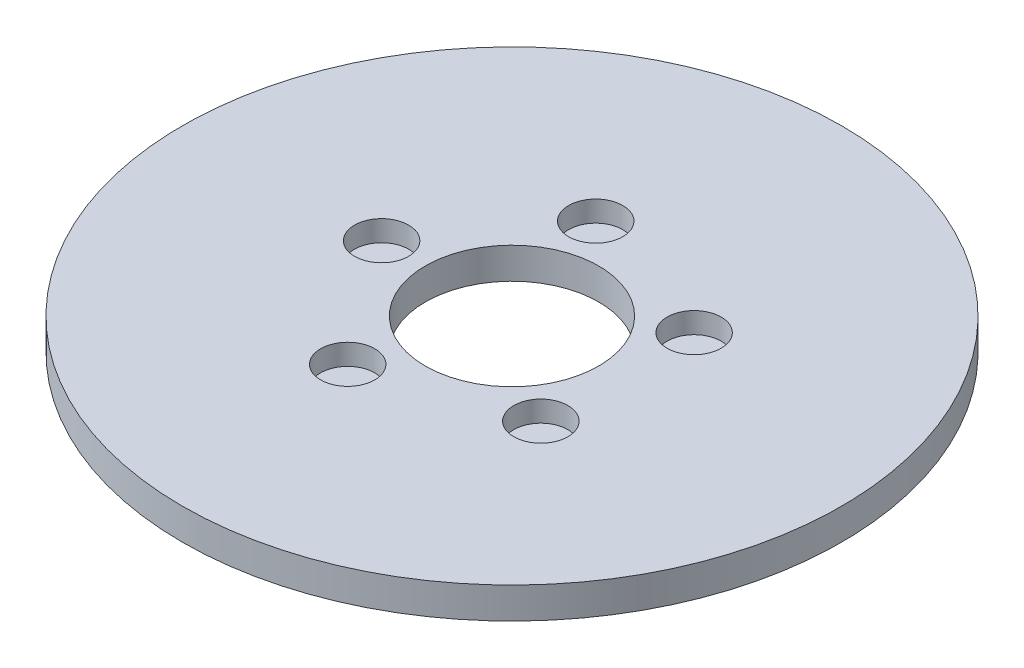
ISO-10303-21;
HEADER;
FILE_DESCRIPTION(('STEP AP214'),'2;1');
FILE_NAME('part.step','',(''),(''),'','','');
FILE_SCHEMA(('AUTOMOTIVE_DESIGN { 1 0 10303 214 1 1 1 1 }'));
ENDSEC;
DATA;
#1=APPLICATION_CONTEXT('core data for automotive mechanical design processes');
#2=APPLICATION_PROTOCOL_DEFINITION('international standard','automotive_design',2000,#1);
#3=PRODUCT_CONTEXT('',#1,'mechanical');
#4=PRODUCT('Part','Part','',(#3));
#5=PRODUCT_RELATED_PRODUCT_CATEGORY('part','',(#4));
#6=PRODUCT_DEFINITION_FORMATION('','',#4);
#7=PRODUCT_DEFINITION_CONTEXT('part definition',#1,'design');
#8=PRODUCT_DEFINITION('design','',#6,#7);
#9=PRODUCT_DEFINITION_SHAPE('','',#8);
#10=(LENGTH_UNIT() NAMED_UNIT(*) SI_UNIT(.MILLI.,.METRE.));
#11=(NAMED_UNIT(*) PLANE_ANGLE_UNIT() SI_UNIT($,.RADIAN.));
#12=(NAMED_UNIT(*) SI_UNIT($,.STERADIAN.) SOLID_ANGLE_UNIT());
#13=UNCERTAINTY_MEASURE_WITH_UNIT(LENGTH_MEASURE(1.E-05),#10,'distance_accuracy_value','');
#14=(GEOMETRIC_REPRESENTATION_CONTEXT(3) GLOBAL_UNCERTAINTY_ASSIGNED_CONTEXT((#13)) GLOBAL_UNIT_ASSIGNED_CONTEXT((#10,
#11,#12)) REPRESENTATION_CONTEXT('',''));
#15=CARTESIAN_POINT('',(0.,0.,0.));
#16=DIRECTION('',(0.,0.,1.));
#17=DIRECTION('',(1.,0.,0.));
#18=AXIS2_PLACEMENT_3D('',#15,#16,#17);
#19=CARTESIAN_POINT('',(0.,9.,0.));
#20=DIRECTION('',(0.,-1.,0.));
#21=DIRECTION('',(0.,0.,-1.));
#22=AXIS2_PLACEMENT_3D('',#19,#20,#21);
#23=CYLINDRICAL_SURFACE('',#22,95.);
#24=CARTESIAN_POINT('',(0.,9.,0.));
#25=DIRECTION('',(0.,1.,0.));
#26=DIRECTION('',(0.,0.,1.));
#27=AXIS2_PLACEMENT_3D('',#24,#25,#26);
#28=CIRCLE('',#27,95.);
#29=CARTESIAN_POINT('',(0.,9.,95.));
#30=VERTEX_POINT('',#29);
#31=EDGE_CURVE('E10',#30,#30,#28,.T.);
#32=ORIENTED_EDGE('',*,*,#31,.F.);
#33=EDGE_LOOP('',(#32));
#34=FACE_BOUND('',#33,.T.);
#35=CARTESIAN_POINT('',(0.,0.,0.));
#36=DIRECTION('',(0.,1.,0.));
#37=DIRECTION('',(0.,0.,1.));
#38=AXIS2_PLACEMENT_3D('',#35,#36,#37);
#39=CIRCLE('',#38,95.);
#40=CARTESIAN_POINT('',(0.,0.,95.));
#41=VERTEX_POINT('',#40);
#42=EDGE_CURVE('E37',#41,#41,#39,.T.);
#43=ORIENTED_EDGE('',*,*,#42,.T.);
#44=EDGE_LOOP('',(#43));
#45=FACE_BOUND('',#44,.T.);
#46=ADVANCED_FACE('F40',(#34,#45),#23,.T.);
#47=CARTESIAN_POINT('',(0.,9.,0.));
#48=DIRECTION('',(0.,1.,0.));
#49=DIRECTION('',(0.,0.,1.));
#50=AXIS2_PLACEMENT_3D('',#47,#48,#49);
#51=PLANE('',#50);
#52=CARTESIAN_POINT('',(-11.615342499618,9.,-35.748348389725));
#53=DIRECTION('',(0.,1.,0.));
#54=DIRECTION('',(-0.95105651629515,0.,0.309016994374958));
#55=AXIS2_PLACEMENT_3D('',#52,#53,#54);
#56=CIRCLE('',#55,7.79796181933174);
#57=CARTESIAN_POINT('',(-11.615342499618,9.,-27.9503865703932));
#58=VERTEX_POINT('',#57);
#59=EDGE_CURVE('E70',#58,#58,#56,.T.);
#60=ORIENTED_EDGE('',*,*,#59,.F.);
#61=EDGE_LOOP('',(#60));
#62=FACE_BOUND('',#61,.T.);
#63=CARTESIAN_POINT('',(30.4093614549698,9.,-22.093694346523));
#64=DIRECTION('',(0.,1.,0.));
#65=DIRECTION('',(-0.58778525229248,0.,-0.809016994374942));
#66=AXIS2_PLACEMENT_3D('',#63,#64,#65);
#67=CIRCLE('',#66,7.79796181933174);
#68=CARTESIAN_POINT('',(30.4093614549698,9.,-14.2957325271912));
#69=VERTEX_POINT('',#68);
#70=EDGE_CURVE('E71',#69,#69,#67,.T.);
#71=ORIENTED_EDGE('',*,*,#70,.F.);
#72=EDGE_LOOP('',(#71));
#73=FACE_BOUND('',#72,.T.);
#74=CARTESIAN_POINT('',(30.4093614549701,9.,22.0936943465225));
#75=DIRECTION('',(0.,1.,0.));
#76=DIRECTION('',(0.587785252292469,0.,-0.809016994374951));
#77=AXIS2_PLACEMENT_3D('',#74,#75,#76);
#78=CIRCLE('',#77,7.79796181933174);
#79=CARTESIAN_POINT('',(30.4093614549701,9.,29.8916561658543));
#80=VERTEX_POINT('',#79);
#81=EDGE_CURVE('E78',#80,#80,#78,.T.);
#82=ORIENTED_EDGE('',*,*,#81,.F.);
#83=EDGE_LOOP('',(#82));
#84=FACE_BOUND('',#83,.T.);
#85=CARTESIAN_POINT('',(-11.6153424996175,9.,35.7483483897251));
#86=DIRECTION('',(0.,1.,0.));
#87=DIRECTION('',(0.951056516295155,0.,0.309016994374945));
#88=AXIS2_PLACEMENT_3D('',#85,#86,#87);
#89=CIRCLE('',#88,7.79796181933174);
#90=CARTESIAN_POINT('',(-11.6153424996175,9.,43.5463102090569));
#91=VERTEX_POINT('',#90);
#92=EDGE_CURVE('E61',#91,#91,#89,.T.);
#93=ORIENTED_EDGE('',*,*,#92,.F.);
#94=EDGE_LOOP('',(#93));
#95=FACE_BOUND('',#94,.T.);
#96=CARTESIAN_POINT('',(-37.5880379107048,9.,0.));
#97=DIRECTION('',(0.,1.,0.));
#98=DIRECTION('',(0.,0.,1.));
#99=AXIS2_PLACEMENT_3D('',#96,#97,#98);
#100=CIRCLE('',#99,7.79796181933174);
#101=CARTESIAN_POINT('',(-37.5880379107048,9.,7.79796181933174));
#102=VERTEX_POINT('',#101);
#103=EDGE_CURVE('E54',#102,#102,#100,.T.);
#104=ORIENTED_EDGE('',*,*,#103,.F.);
#105=EDGE_LOOP('',(#104));
#106=FACE_BOUND('',#105,.T.);
#107=CARTESIAN_POINT('',(0.,9.,0.));
#108=DIRECTION('',(0.,1.,0.));
#109=DIRECTION('',(0.,0.,1.));
#110=AXIS2_PLACEMENT_3D('',#107,#108,#109);
#111=CIRCLE('',#110,25.);
#112=CARTESIAN_POINT('',(0.,9.,25.));
#113=VERTEX_POINT('',#112);
#114=EDGE_CURVE('E50',#113,#113,#111,.T.);
#115=ORIENTED_EDGE('',*,*,#114,.F.);
#116=EDGE_LOOP('',(#115));
#117=FACE_BOUND('',#116,.T.);
#118=ORIENTED_EDGE('',*,*,#31,.T.);
#119=EDGE_LOOP('',(#118));
#120=FACE_BOUND('',#119,.T.);
#121=ADVANCED_FACE('F94',(#62,#73,#84,#95,#106,#117,#120),#51,.T.);
#122=CARTESIAN_POINT('',(0.,0.,0.));
#123=DIRECTION('',(0.,1.,0.));
#124=DIRECTION('',(0.,0.,1.));
#125=AXIS2_PLACEMENT_3D('',#122,#123,#124);
#126=PLANE('',#125);
#127=CARTESIAN_POINT('',(0.,0.,0.));
#128=DIRECTION('',(0.,1.,0.));
#129=DIRECTION('',(0.,0.,1.));
#130=AXIS2_PLACEMENT_3D('',#127,#128,#129);
#131=CIRCLE('',#130,25.);
#132=CARTESIAN_POINT('',(0.,0.,25.));
#133=VERTEX_POINT('',#132);
#134=EDGE_CURVE('E47',#133,#133,#131,.T.);
#135=ORIENTED_EDGE('',*,*,#134,.T.);
#136=EDGE_LOOP('',(#135));
#137=FACE_BOUND('',#136,.T.);
#138=ORIENTED_EDGE('',*,*,#42,.F.);
#139=EDGE_LOOP('',(#138));
#140=FACE_BOUND('',#139,.T.);
#141=ADVANCED_FACE('F100',(#137,#140),#126,.F.);
#142=CARTESIAN_POINT('',(0.,9.,0.));
#143=DIRECTION('',(0.,-1.,0.));
#144=DIRECTION('',(0.,0.,-1.));
#145=AXIS2_PLACEMENT_3D('',#142,#143,#144);
#146=CYLINDRICAL_SURFACE('',#145,25.);
#147=ORIENTED_EDGE('',*,*,#114,.T.);
#148=EDGE_LOOP('',(#147));
#149=FACE_BOUND('',#148,.T.);
#150=ORIENTED_EDGE('',*,*,#134,.F.);
#151=EDGE_LOOP('',(#150));
#152=FACE_BOUND('',#151,.T.);
#153=ADVANCED_FACE('F106',(#149,#152),#146,.F.);
#154=CARTESIAN_POINT('',(-37.5880379107048,2.9747478807375,0.));
#155=DIRECTION('',(0.,1.,0.));
#156=DIRECTION('',(0.,0.,1.));
#157=AXIS2_PLACEMENT_3D('',#154,#155,#156);
#158=CYLINDRICAL_SURFACE('',#157,7.79796181933174);
#159=CARTESIAN_POINT('',(-37.5880379107048,2.9747478807375,0.));
#160=DIRECTION('',(0.,1.,0.));
#161=DIRECTION('',(0.,0.,1.));
#162=AXIS2_PLACEMENT_3D('',#159,#160,#161);
#163=CIRCLE('',#162,7.79796181933174);
#164=CARTESIAN_POINT('',(-37.5880379107048,2.9747478807375,7.79796181933174));
#165=VERTEX_POINT('',#164);
#166=EDGE_CURVE('E55',#165,#165,#163,.T.);
#167=CARTESIAN_POINT('',(-37.5880379107048,2.9747478807375,7.79796181933174));
#168=CARTESIAN_POINT('',(-37.5880379107048,3.03751092364648,7.79796181933174));
#169=CARTESIAN_POINT('',(-37.5880379107048,3.10027396655547,7.79796181933174));
#170=CARTESIAN_POINT('',(-37.5880379107048,3.22580005237343,7.79796181933174));
#171=CARTESIAN_POINT('',(-37.5880379107048,3.28856309528242,7.79796181933174));
#172=CARTESIAN_POINT('',(-37.5880379107048,3.41408918110039,7.79796181933174));
#173=CARTESIAN_POINT('',(-37.5880379107048,3.47685222400937,7.79796181933174));
#174=CARTESIAN_POINT('',(-37.5880379107048,3.60237830982734,7.79796181933174));
#175=CARTESIAN_POINT('',(-37.5880379107048,3.66514135273633,7.79796181933174));
#176=CARTESIAN_POINT('',(-37.5880379107048,3.79066743855429,7.79796181933174));
#177=CARTESIAN_POINT('',(-37.5880379107048,3.85343048146328,7.79796181933174));
#178=CARTESIAN_POINT('',(-37.5880379107048,3.97895656728125,7.79796181933174));
#179=CARTESIAN_POINT('',(-37.5880379107048,4.04171961019023,7.79796181933174));
#180=CARTESIAN_POINT('',(-37.5880379107048,4.1672456960082,7.79796181933174));
#181=CARTESIAN_POINT('',(-37.5880379107048,4.23000873891719,7.79796181933174));
#182=CARTESIAN_POINT('',(-37.5880379107048,4.35553482473515,7.79796181933174));
#183=CARTESIAN_POINT('',(-37.5880379107048,4.41829786764414,7.79796181933174));
#184=CARTESIAN_POINT('',(-37.5880379107048,4.54382395346211,7.79796181933174));
#185=CARTESIAN_POINT('',(-37.5880379107048,4.60658699637109,7.79796181933174));
#186=CARTESIAN_POINT('',(-37.5880379107048,4.73211308218906,7.79796181933174));
#187=CARTESIAN_POINT('',(-37.5880379107048,4.79487612509805,7.79796181933174));
#188=CARTESIAN_POINT('',(-37.5880379107048,4.92040221091601,7.79796181933174));
#189=CARTESIAN_POINT('',(-37.5880379107048,4.983165253825,7.79796181933174));
#190=CARTESIAN_POINT('',(-37.5880379107048,5.10869133964297,7.79796181933174));
#191=CARTESIAN_POINT('',(-37.5880379107048,5.17145438255195,7.79796181933174));
#192=CARTESIAN_POINT('',(-37.5880379107048,5.29698046836992,7.79796181933174));
#193=CARTESIAN_POINT('',(-37.5880379107048,5.3597435112789,7.79796181933174));
#194=CARTESIAN_POINT('',(-37.5880379107048,5.48526959709687,7.79796181933174));
#195=CARTESIAN_POINT('',(-37.5880379107048,5.54803264000586,7.79796181933174));
#196=CARTESIAN_POINT('',(-37.5880379107048,5.67355872582383,7.79796181933174));
#197=CARTESIAN_POINT('',(-37.5880379107048,5.73632176873281,7.79796181933174));
#198=CARTESIAN_POINT('',(-37.5880379107048,5.86184785455078,7.79796181933174));
#199=CARTESIAN_POINT('',(-37.5880379107048,5.92461089745976,7.79796181933174));
#200=CARTESIAN_POINT('',(-37.5880379107048,6.05013698327773,7.79796181933174));
#201=CARTESIAN_POINT('',(-37.5880379107048,6.11290002618672,7.79796181933174));
#202=CARTESIAN_POINT('',(-37.5880379107048,6.23842611200469,7.79796181933174));
#203=CARTESIAN_POINT('',(-37.5880379107048,6.30118915491367,7.79796181933174));
#204=CARTESIAN_POINT('',(-37.5880379107048,6.42671524073164,7.79796181933174));
#205=CARTESIAN_POINT('',(-37.5880379107048,6.48947828364062,7.79796181933174));
#206=CARTESIAN_POINT('',(-37.5880379107048,6.61500436945859,7.79796181933174));
#207=CARTESIAN_POINT('',(-37.5880379107048,6.67776741236758,7.79796181933174));
#208=CARTESIAN_POINT('',(-37.5880379107048,6.80329349818555,7.79796181933174));
#209=CARTESIAN_POINT('',(-37.5880379107048,6.86605654109453,7.79796181933174));
#210=CARTESIAN_POINT('',(-37.5880379107048,6.9915826269125,7.79796181933174));
#211=CARTESIAN_POINT('',(-37.5880379107048,7.05434566982148,7.79796181933174));
#212=CARTESIAN_POINT('',(-37.5880379107048,7.17987175563945,7.79796181933174));
#213=CARTESIAN_POINT('',(-37.5880379107048,7.24263479854844,7.79796181933174));
#214=CARTESIAN_POINT('',(-37.5880379107048,7.3681608843664,7.79796181933174));
#215=CARTESIAN_POINT('',(-37.5880379107048,7.43092392727539,7.79796181933174));
#216=CARTESIAN_POINT('',(-37.5880379107048,7.55645001309336,7.79796181933174));
#217=CARTESIAN_POINT('',(-37.5880379107048,7.61921305600234,7.79796181933174));
#218=CARTESIAN_POINT('',(-37.5880379107048,7.74473914182031,7.79796181933174));
#219=CARTESIAN_POINT('',(-37.5880379107048,7.8075021847293,7.79796181933174));
#220=CARTESIAN_POINT('',(-37.5880379107048,7.93302827054726,7.79796181933174));
#221=CARTESIAN_POINT('',(-37.5880379107048,7.99579131345625,7.79796181933174));
#222=CARTESIAN_POINT('',(-37.5880379107048,8.12131739927422,7.79796181933174));
#223=CARTESIAN_POINT('',(-37.5880379107048,8.1840804421832,7.79796181933174));
#224=CARTESIAN_POINT('',(-37.5880379107048,8.30960652800117,7.79796181933174));
#225=CARTESIAN_POINT('',(-37.5880379107048,8.37236957091016,7.79796181933174));
#226=CARTESIAN_POINT('',(-37.5880379107048,8.49789565672812,7.79796181933174));
#227=CARTESIAN_POINT('',(-37.5880379107048,8.56065869963711,7.79796181933174));
#228=CARTESIAN_POINT('',(-37.5880379107048,8.68618478545508,7.79796181933174));
#229=CARTESIAN_POINT('',(-37.5880379107048,8.74894782836406,7.79796181933174));
#230=CARTESIAN_POINT('',(-37.5880379107048,8.87447391418203,7.79796181933174));
#231=CARTESIAN_POINT('',(-37.5880379107048,8.93723695709101,7.79796181933174));
#232=CARTESIAN_POINT('',(-37.5880379107048,9.,7.79796181933174));
#233=B_SPLINE_CURVE_WITH_KNOTS('',3,(#167,#168,#169,#170,#171,#172,#173,#174,#175,#176,#177,
#178,#179,#180,#181,#182,#183,#184,#185,#186,#187,#188,#189,#190,#191,#192,#193,#194,#195,#196,
#197,#198,#199,#200,#201,#202,#203,#204,#205,#206,#207,#208,#209,#210,#211,#212,#213,#214,#215,
#216,#217,#218,#219,#220,#221,#222,#223,#224,#225,#226,#227,#228,#229,#230,#231,#232),
.UNSPECIFIED.,.F.,.F.,(4,2,2,2,2,2,2,2,2,2,2,2,2,2,2,2,2,2,2,2,2,2,2,2,2,2,2,2,2,2,2,2,4),(0.,
0.188289128726953,0.376578257453906,0.564867386180859,0.753156514907813,0.941445643634766,
1.12973477236172,1.31802390108867,1.50631302981563,1.69460215854258,1.88289128726953,
2.07118041599649,2.25946954472344,2.44775867345039,2.63604780217734,2.8243369309043,
3.01262605963125,3.2009151883582,3.38920431708516,3.57749344581211,3.76578257453906,
3.95407170326602,4.14236083199297,4.33064996071992,4.51893908944688,4.70722821817383,
4.89551734690078,5.08380647562774,5.27209560435469,5.46038473308164,5.6486738618086,
5.83696299053555,6.0252521192625),.UNSPECIFIED.);
#234=EDGE_CURVE('BSEAM108',#165,#102,#233,.T.);
#235=ORIENTED_EDGE('',*,*,#166,.F.);
#236=ORIENTED_EDGE('',*,*,#103,.T.);
#237=ORIENTED_EDGE('',*,*,#234,.T.);
#238=ORIENTED_EDGE('',*,*,#234,.F.);
#239=EDGE_LOOP('',(#235,#237,#236,#238));
#240=FACE_BOUND('',#239,.T.);
#241=ADVANCED_FACE('F108',(#240),#158,.F.);
#242=CARTESIAN_POINT('',(-37.5880379107048,2.9747478807375,0.));
#243=DIRECTION('',(0.,1.,0.));
#244=DIRECTION('',(0.,0.,1.));
#245=AXIS2_PLACEMENT_3D('',#242,#243,#244);
#246=PLANE('',#245);
#247=ORIENTED_EDGE('',*,*,#166,.T.);
#248=EDGE_LOOP('',(#247));
#249=FACE_BOUND('',#248,.T.);
#250=ADVANCED_FACE('F138',(#249),#246,.T.);
#251=CARTESIAN_POINT('',(-11.6153424996175,2.9747478807375,35.7483483897251));
#252=DIRECTION('',(0.,1.,0.));
#253=DIRECTION('',(0.,0.,1.));
#254=AXIS2_PLACEMENT_3D('',#251,#252,#253);
#255=CYLINDRICAL_SURFACE('',#254,7.79796181933174);
#256=CARTESIAN_POINT('',(-11.6153424996175,2.9747478807375,35.7483483897251));
#257=DIRECTION('',(0.,1.,0.));
#258=DIRECTION('',(0.951056516295155,0.,0.309016994374945));
#259=AXIS2_PLACEMENT_3D('',#256,#257,#258);
#260=CIRCLE('',#259,7.79796181933174);
#261=CARTESIAN_POINT('',(-11.6153424996175,2.9747478807375,43.5463102090569));
#262=VERTEX_POINT('',#261);
#263=EDGE_CURVE('E59',#262,#262,#260,.T.);
#264=CARTESIAN_POINT('',(-11.6153424996175,2.9747478807375,43.5463102090569));
#265=CARTESIAN_POINT('',(-11.6153424996175,3.03751092364648,43.5463102090569));
#266=CARTESIAN_POINT('',(-11.6153424996175,3.10027396655547,43.5463102090569));
#267=CARTESIAN_POINT('',(-11.6153424996175,3.22580005237343,43.5463102090569));
#268=CARTESIAN_POINT('',(-11.6153424996175,3.28856309528242,43.5463102090569));
#269=CARTESIAN_POINT('',(-11.6153424996175,3.41408918110039,43.5463102090569));
#270=CARTESIAN_POINT('',(-11.6153424996175,3.47685222400937,43.5463102090569));
#271=CARTESIAN_POINT('',(-11.6153424996175,3.60237830982734,43.5463102090569));
#272=CARTESIAN_POINT('',(-11.6153424996175,3.66514135273633,43.5463102090569));
#273=CARTESIAN_POINT('',(-11.6153424996175,3.79066743855429,43.5463102090569));
#274=CARTESIAN_POINT('',(-11.6153424996175,3.85343048146328,43.5463102090569));
#275=CARTESIAN_POINT('',(-11.6153424996175,3.97895656728125,43.5463102090569));
#276=CARTESIAN_POINT('',(-11.6153424996175,4.04171961019023,43.5463102090569));
#277=CARTESIAN_POINT('',(-11.6153424996175,4.1672456960082,43.5463102090569));
#278=CARTESIAN_POINT('',(-11.6153424996175,4.23000873891719,43.5463102090569));
#279=CARTESIAN_POINT('',(-11.6153424996175,4.35553482473515,43.5463102090569));
#280=CARTESIAN_POINT('',(-11.6153424996175,4.41829786764414,43.5463102090569));
#281=CARTESIAN_POINT('',(-11.6153424996175,4.54382395346211,43.5463102090569));
#282=CARTESIAN_POINT('',(-11.6153424996175,4.60658699637109,43.5463102090569));
#283=CARTESIAN_POINT('',(-11.6153424996175,4.73211308218906,43.5463102090569));
#284=CARTESIAN_POINT('',(-11.6153424996175,4.79487612509805,43.5463102090569));
#285=CARTESIAN_POINT('',(-11.6153424996175,4.92040221091601,43.5463102090569));
#286=CARTESIAN_POINT('',(-11.6153424996175,4.983165253825,43.5463102090569));
#287=CARTESIAN_POINT('',(-11.6153424996175,5.10869133964297,43.5463102090569));
#288=CARTESIAN_POINT('',(-11.6153424996175,5.17145438255195,43.5463102090569));
#289=CARTESIAN_POINT('',(-11.6153424996175,5.29698046836992,43.5463102090569));
#290=CARTESIAN_POINT('',(-11.6153424996175,5.3597435112789,43.5463102090569));
#291=CARTESIAN_POINT('',(-11.6153424996175,5.48526959709687,43.5463102090569));
#292=CARTESIAN_POINT('',(-11.6153424996175,5.54803264000586,43.5463102090569));
#293=CARTESIAN_POINT('',(-11.6153424996175,5.67355872582383,43.5463102090569));
#294=CARTESIAN_POINT('',(-11.6153424996175,5.73632176873281,43.5463102090569));
#295=CARTESIAN_POINT('',(-11.6153424996175,5.86184785455078,43.5463102090569));
#296=CARTESIAN_POINT('',(-11.6153424996175,5.92461089745976,43.5463102090569));
#297=CARTESIAN_POINT('',(-11.6153424996175,6.05013698327773,43.5463102090569));
#298=CARTESIAN_POINT('',(-11.6153424996175,6.11290002618672,43.5463102090569));
#299=CARTESIAN_POINT('',(-11.6153424996175,6.23842611200469,43.5463102090569));
#300=CARTESIAN_POINT('',(-11.6153424996175,6.30118915491367,43.5463102090569));
#301=CARTESIAN_POINT('',(-11.6153424996175,6.42671524073164,43.5463102090569));
#302=CARTESIAN_POINT('',(-11.6153424996175,6.48947828364062,43.5463102090569));
#303=CARTESIAN_POINT('',(-11.6153424996175,6.61500436945859,43.5463102090569));
#304=CARTESIAN_POINT('',(-11.6153424996175,6.67776741236758,43.5463102090569));
#305=CARTESIAN_POINT('',(-11.6153424996175,6.80329349818555,43.5463102090569));
#306=CARTESIAN_POINT('',(-11.6153424996175,6.86605654109453,43.5463102090569));
#307=CARTESIAN_POINT('',(-11.6153424996175,6.9915826269125,43.5463102090569));
#308=CARTESIAN_POINT('',(-11.6153424996175,7.05434566982148,43.5463102090569));
#309=CARTESIAN_POINT('',(-11.6153424996175,7.17987175563945,43.5463102090569));
#310=CARTESIAN_POINT('',(-11.6153424996175,7.24263479854844,43.5463102090569));
#311=CARTESIAN_POINT('',(-11.6153424996175,7.3681608843664,43.5463102090569));
#312=CARTESIAN_POINT('',(-11.6153424996175,7.43092392727539,43.5463102090569));
#313=CARTESIAN_POINT('',(-11.6153424996175,7.55645001309336,43.5463102090569));
#314=CARTESIAN_POINT('',(-11.6153424996175,7.61921305600234,43.5463102090569));
#315=CARTESIAN_POINT('',(-11.6153424996175,7.74473914182031,43.5463102090569));
#316=CARTESIAN_POINT('',(-11.6153424996175,7.8075021847293,43.5463102090569));
#317=CARTESIAN_POINT('',(-11.6153424996175,7.93302827054726,43.5463102090569));
#318=CARTESIAN_POINT('',(-11.6153424996175,7.99579131345625,43.5463102090569));
#319=CARTESIAN_POINT('',(-11.6153424996175,8.12131739927422,43.5463102090569));
#320=CARTESIAN_POINT('',(-11.6153424996175,8.1840804421832,43.5463102090569));
#321=CARTESIAN_POINT('',(-11.6153424996175,8.30960652800117,43.5463102090569));
#322=CARTESIAN_POINT('',(-11.6153424996175,8.37236957091016,43.5463102090569));
#323=CARTESIAN_POINT('',(-11.6153424996175,8.49789565672812,43.5463102090569));
#324=CARTESIAN_POINT('',(-11.6153424996175,8.56065869963711,43.5463102090569));
#325=CARTESIAN_POINT('',(-11.6153424996175,8.68618478545508,43.5463102090569));
#326=CARTESIAN_POINT('',(-11.6153424996175,8.74894782836406,43.5463102090569));
#327=CARTESIAN_POINT('',(-11.6153424996175,8.87447391418203,43.5463102090569));
#328=CARTESIAN_POINT('',(-11.6153424996175,8.93723695709101,43.5463102090569));
#329=CARTESIAN_POINT('',(-11.6153424996175,9.,43.5463102090569));
#330=B_SPLINE_CURVE_WITH_KNOTS('',3,(#264,#265,#266,#267,#268,#269,#270,#271,#272,#273,#274,
#275,#276,#277,#278,#279,#280,#281,#282,#283,#284,#285,#286,#287,#288,#289,#290,#291,#292,#293,
#294,#295,#296,#297,#298,#299,#300,#301,#302,#303,#304,#305,#306,#307,#308,#309,#310,#311,#312,
#313,#314,#315,#316,#317,#318,#319,#320,#321,#322,#323,#324,#325,#326,#327,#328,#329),
.UNSPECIFIED.,.F.,.F.,(4,2,2,2,2,2,2,2,2,2,2,2,2,2,2,2,2,2,2,2,2,2,2,2,2,2,2,2,2,2,2,2,4),(0.,
0.188289128726953,0.376578257453906,0.564867386180859,0.753156514907813,0.941445643634766,
1.12973477236172,1.31802390108867,1.50631302981563,1.69460215854258,1.88289128726953,
2.07118041599649,2.25946954472344,2.44775867345039,2.63604780217734,2.8243369309043,
3.01262605963125,3.2009151883582,3.38920431708516,3.57749344581211,3.76578257453906,
3.95407170326602,4.14236083199297,4.33064996071992,4.51893908944688,4.70722821817383,
4.89551734690078,5.08380647562774,5.27209560435469,5.46038473308164,5.6486738618086,
5.83696299053555,6.0252521192625),.UNSPECIFIED.);
#331=EDGE_CURVE('BSEAM150',#262,#91,#330,.T.);
#332=ORIENTED_EDGE('',*,*,#263,.F.);
#333=ORIENTED_EDGE('',*,*,#92,.T.);
#334=ORIENTED_EDGE('',*,*,#331,.T.);
#335=ORIENTED_EDGE('',*,*,#331,.F.);
#336=EDGE_LOOP('',(#332,#334,#333,#335));
#337=FACE_BOUND('',#336,.T.);
#338=ADVANCED_FACE('F150',(#337),#255,.F.);
#339=CARTESIAN_POINT('',(-11.6153424996175,2.9747478807375,35.7483483897251));
#340=DIRECTION('',(0.,1.,0.));
#341=DIRECTION('',(0.951056516295155,0.,0.309016994374945));
#342=AXIS2_PLACEMENT_3D('',#339,#340,#341);
#343=PLANE('',#342);
#344=ORIENTED_EDGE('',*,*,#263,.T.);
#345=EDGE_LOOP('',(#344));
#346=FACE_BOUND('',#345,.T.);
#347=ADVANCED_FACE('F89',(#346),#343,.T.);
#348=CARTESIAN_POINT('',(30.4093614549701,2.9747478807375,22.0936943465225));
#349=DIRECTION('',(0.,1.,0.));
#350=DIRECTION('',(0.,0.,1.));
#351=AXIS2_PLACEMENT_3D('',#348,#349,#350);
#352=CYLINDRICAL_SURFACE('',#351,7.79796181933174);
#353=CARTESIAN_POINT('',(30.4093614549701,2.9747478807375,22.0936943465225));
#354=DIRECTION('',(0.,1.,0.));
#355=DIRECTION('',(0.587785252292469,0.,-0.809016994374951));
#356=AXIS2_PLACEMENT_3D('',#353,#354,#355);
#357=CIRCLE('',#356,7.79796181933174);
#358=CARTESIAN_POINT('',(30.4093614549701,2.9747478807375,29.8916561658543));
#359=VERTEX_POINT('',#358);
#360=EDGE_CURVE('E63',#359,#359,#357,.T.);
#361=CARTESIAN_POINT('',(30.4093614549701,2.9747478807375,29.8916561658543));
#362=CARTESIAN_POINT('',(30.4093614549701,3.03751092364648,29.8916561658543));
#363=CARTESIAN_POINT('',(30.4093614549701,3.10027396655547,29.8916561658543));
#364=CARTESIAN_POINT('',(30.4093614549701,3.22580005237343,29.8916561658543));
#365=CARTESIAN_POINT('',(30.4093614549701,3.28856309528242,29.8916561658543));
#366=CARTESIAN_POINT('',(30.4093614549701,3.41408918110039,29.8916561658543));
#367=CARTESIAN_POINT('',(30.4093614549701,3.47685222400937,29.8916561658543));
#368=CARTESIAN_POINT('',(30.4093614549701,3.60237830982734,29.8916561658543));
#369=CARTESIAN_POINT('',(30.4093614549701,3.66514135273633,29.8916561658543));
#370=CARTESIAN_POINT('',(30.4093614549701,3.79066743855429,29.8916561658543));
#371=CARTESIAN_POINT('',(30.4093614549701,3.85343048146328,29.8916561658543));
#372=CARTESIAN_POINT('',(30.4093614549701,3.97895656728125,29.8916561658543));
#373=CARTESIAN_POINT('',(30.4093614549701,4.04171961019023,29.8916561658543));
#374=CARTESIAN_POINT('',(30.4093614549701,4.1672456960082,29.8916561658543));
#375=CARTESIAN_POINT('',(30.4093614549701,4.23000873891719,29.8916561658543));
#376=CARTESIAN_POINT('',(30.4093614549701,4.35553482473515,29.8916561658543));
#377=CARTESIAN_POINT('',(30.4093614549701,4.41829786764414,29.8916561658543));
#378=CARTESIAN_POINT('',(30.4093614549701,4.54382395346211,29.8916561658543));
#379=CARTESIAN_POINT('',(30.4093614549701,4.60658699637109,29.8916561658543));
#380=CARTESIAN_POINT('',(30.4093614549701,4.73211308218906,29.8916561658543));
#381=CARTESIAN_POINT('',(30.4093614549701,4.79487612509805,29.8916561658543));
#382=CARTESIAN_POINT('',(30.4093614549701,4.92040221091601,29.8916561658543));
#383=CARTESIAN_POINT('',(30.4093614549701,4.983165253825,29.8916561658543));
#384=CARTESIAN_POINT('',(30.4093614549701,5.10869133964297,29.8916561658543));
#385=CARTESIAN_POINT('',(30.4093614549701,5.17145438255195,29.8916561658543));
#386=CARTESIAN_POINT('',(30.4093614549701,5.29698046836992,29.8916561658543));
#387=CARTESIAN_POINT('',(30.4093614549701,5.3597435112789,29.8916561658543));
#388=CARTESIAN_POINT('',(30.4093614549701,5.48526959709687,29.8916561658543));
#389=CARTESIAN_POINT('',(30.4093614549701,5.54803264000586,29.8916561658543));
#390=CARTESIAN_POINT('',(30.4093614549701,5.67355872582383,29.8916561658543));
#391=CARTESIAN_POINT('',(30.4093614549701,5.73632176873281,29.8916561658543));
#392=CARTESIAN_POINT('',(30.4093614549701,5.86184785455078,29.8916561658543));
#393=CARTESIAN_POINT('',(30.4093614549701,5.92461089745976,29.8916561658543));
#394=CARTESIAN_POINT('',(30.4093614549701,6.05013698327773,29.8916561658543));
#395=CARTESIAN_POINT('',(30.4093614549701,6.11290002618672,29.8916561658543));
#396=CARTESIAN_POINT('',(30.4093614549701,6.23842611200469,29.8916561658543));
#397=CARTESIAN_POINT('',(30.4093614549701,6.30118915491367,29.8916561658543));
#398=CARTESIAN_POINT('',(30.4093614549701,6.42671524073164,29.8916561658543));
#399=CARTESIAN_POINT('',(30.4093614549701,6.48947828364062,29.8916561658543));
#400=CARTESIAN_POINT('',(30.4093614549701,6.61500436945859,29.8916561658543));
#401=CARTESIAN_POINT('',(30.4093614549701,6.67776741236758,29.8916561658543));
#402=CARTESIAN_POINT('',(30.4093614549701,6.80329349818555,29.8916561658543));
#403=CARTESIAN_POINT('',(30.4093614549701,6.86605654109453,29.8916561658543));
#404=CARTESIAN_POINT('',(30.4093614549701,6.9915826269125,29.8916561658543));
#405=CARTESIAN_POINT('',(30.4093614549701,7.05434566982148,29.8916561658543));
#406=CARTESIAN_POINT('',(30.4093614549701,7.17987175563945,29.8916561658543));
#407=CARTESIAN_POINT('',(30.4093614549701,7.24263479854844,29.8916561658543));
#408=CARTESIAN_POINT('',(30.4093614549701,7.3681608843664,29.8916561658543));
#409=CARTESIAN_POINT('',(30.4093614549701,7.43092392727539,29.8916561658543));
#410=CARTESIAN_POINT('',(30.4093614549701,7.55645001309336,29.8916561658543));
#411=CARTESIAN_POINT('',(30.4093614549701,7.61921305600234,29.8916561658543));
#412=CARTESIAN_POINT('',(30.4093614549701,7.74473914182031,29.8916561658543));
#413=CARTESIAN_POINT('',(30.4093614549701,7.8075021847293,29.8916561658543));
#414=CARTESIAN_POINT('',(30.4093614549701,7.93302827054726,29.8916561658543));
#415=CARTESIAN_POINT('',(30.4093614549701,7.99579131345625,29.8916561658543));
#416=CARTESIAN_POINT('',(30.4093614549701,8.12131739927422,29.8916561658543));
#417=CARTESIAN_POINT('',(30.4093614549701,8.1840804421832,29.8916561658543));
#418=CARTESIAN_POINT('',(30.4093614549701,8.30960652800117,29.8916561658543));
#419=CARTESIAN_POINT('',(30.4093614549701,8.37236957091016,29.8916561658543));
#420=CARTESIAN_POINT('',(30.4093614549701,8.49789565672812,29.8916561658543));
#421=CARTESIAN_POINT('',(30.4093614549701,8.56065869963711,29.8916561658543));
#422=CARTESIAN_POINT('',(30.4093614549701,8.68618478545508,29.8916561658543));
#423=CARTESIAN_POINT('',(30.4093614549701,8.74894782836406,29.8916561658543));
#424=CARTESIAN_POINT('',(30.4093614549701,8.87447391418203,29.8916561658543));
#425=CARTESIAN_POINT('',(30.4093614549701,8.93723695709101,29.8916561658543));
#426=CARTESIAN_POINT('',(30.4093614549701,9.,29.8916561658543));
#427=B_SPLINE_CURVE_WITH_KNOTS('',3,(#361,#362,#363,#364,#365,#366,#367,#368,#369,#370,#371,
#372,#373,#374,#375,#376,#377,#378,#379,#380,#381,#382,#383,#384,#385,#386,#387,#388,#389,#390,
#391,#392,#393,#394,#395,#396,#397,#398,#399,#400,#401,#402,#403,#404,#405,#406,#407,#408,#409,
#410,#411,#412,#413,#414,#415,#416,#417,#418,#419,#420,#421,#422,#423,#424,#425,#426),
.UNSPECIFIED.,.F.,.F.,(4,2,2,2,2,2,2,2,2,2,2,2,2,2,2,2,2,2,2,2,2,2,2,2,2,2,2,2,2,2,2,2,4),(0.,
0.188289128726953,0.376578257453906,0.564867386180859,0.753156514907813,0.941445643634766,
1.12973477236172,1.31802390108867,1.50631302981563,1.69460215854258,1.88289128726953,
2.07118041599649,2.25946954472344,2.44775867345039,2.63604780217734,2.8243369309043,
3.01262605963125,3.2009151883582,3.38920431708516,3.57749344581211,3.76578257453906,
3.95407170326602,4.14236083199297,4.33064996071992,4.51893908944688,4.70722821817383,
4.89551734690078,5.08380647562774,5.27209560435469,5.46038473308164,5.6486738618086,
5.83696299053555,6.0252521192625),.UNSPECIFIED.);
#428=EDGE_CURVE('BSEAM87',#359,#80,#427,.T.);
#429=ORIENTED_EDGE('',*,*,#360,.F.);
#430=ORIENTED_EDGE('',*,*,#81,.T.);
#431=ORIENTED_EDGE('',*,*,#428,.T.);
#432=ORIENTED_EDGE('',*,*,#428,.F.);
#433=EDGE_LOOP('',(#429,#431,#430,#432));
#434=FACE_BOUND('',#433,.T.);
#435=ADVANCED_FACE('F87',(#434),#352,.F.);
#436=CARTESIAN_POINT('',(30.4093614549701,2.9747478807375,22.0936943465225));
#437=DIRECTION('',(0.,1.,0.));
#438=DIRECTION('',(0.587785252292469,0.,-0.809016994374951));
#439=AXIS2_PLACEMENT_3D('',#436,#437,#438);
#440=PLANE('',#439);
#441=ORIENTED_EDGE('',*,*,#360,.T.);
#442=EDGE_LOOP('',(#441));
#443=FACE_BOUND('',#442,.T.);
#444=ADVANCED_FACE('F84',(#443),#440,.T.);
#445=CARTESIAN_POINT('',(30.4093614549698,2.9747478807375,-22.093694346523));
#446=DIRECTION('',(0.,1.,0.));
#447=DIRECTION('',(0.,0.,1.));
#448=AXIS2_PLACEMENT_3D('',#445,#446,#447);
#449=CYLINDRICAL_SURFACE('',#448,7.79796181933174);
#450=CARTESIAN_POINT('',(30.4093614549698,2.9747478807375,-22.093694346523));
#451=DIRECTION('',(0.,1.,0.));
#452=DIRECTION('',(-0.58778525229248,0.,-0.809016994374942));
#453=AXIS2_PLACEMENT_3D('',#450,#451,#452);
#454=CIRCLE('',#453,7.79796181933174);
#455=CARTESIAN_POINT('',(30.4093614549698,2.9747478807375,-14.2957325271912));
#456=VERTEX_POINT('',#455);
#457=EDGE_CURVE('E76',#456,#456,#454,.T.);
#458=CARTESIAN_POINT('',(30.4093614549698,2.9747478807375,-14.2957325271912));
#459=CARTESIAN_POINT('',(30.4093614549698,3.03751092364648,-14.2957325271912));
#460=CARTESIAN_POINT('',(30.4093614549698,3.10027396655547,-14.2957325271912));
#461=CARTESIAN_POINT('',(30.4093614549698,3.22580005237343,-14.2957325271912));
#462=CARTESIAN_POINT('',(30.4093614549698,3.28856309528242,-14.2957325271912));
#463=CARTESIAN_POINT('',(30.4093614549698,3.41408918110039,-14.2957325271912));
#464=CARTESIAN_POINT('',(30.4093614549698,3.47685222400937,-14.2957325271912));
#465=CARTESIAN_POINT('',(30.4093614549698,3.60237830982734,-14.2957325271912));
#466=CARTESIAN_POINT('',(30.4093614549698,3.66514135273633,-14.2957325271912));
#467=CARTESIAN_POINT('',(30.4093614549698,3.79066743855429,-14.2957325271912));
#468=CARTESIAN_POINT('',(30.4093614549698,3.85343048146328,-14.2957325271912));
#469=CARTESIAN_POINT('',(30.4093614549698,3.97895656728125,-14.2957325271912));
#470=CARTESIAN_POINT('',(30.4093614549698,4.04171961019023,-14.2957325271912));
#471=CARTESIAN_POINT('',(30.4093614549698,4.1672456960082,-14.2957325271912));
#472=CARTESIAN_POINT('',(30.4093614549698,4.23000873891719,-14.2957325271912));
#473=CARTESIAN_POINT('',(30.4093614549698,4.35553482473515,-14.2957325271912));
#474=CARTESIAN_POINT('',(30.4093614549698,4.41829786764414,-14.2957325271912));
#475=CARTESIAN_POINT('',(30.4093614549698,4.54382395346211,-14.2957325271912));
#476=CARTESIAN_POINT('',(30.4093614549698,4.60658699637109,-14.2957325271912));
#477=CARTESIAN_POINT('',(30.4093614549698,4.73211308218906,-14.2957325271912));
#478=CARTESIAN_POINT('',(30.4093614549698,4.79487612509805,-14.2957325271912));
#479=CARTESIAN_POINT('',(30.4093614549698,4.92040221091601,-14.2957325271912));
#480=CARTESIAN_POINT('',(30.4093614549698,4.983165253825,-14.2957325271912));
#481=CARTESIAN_POINT('',(30.4093614549698,5.10869133964297,-14.2957325271912));
#482=CARTESIAN_POINT('',(30.4093614549698,5.17145438255195,-14.2957325271912));
#483=CARTESIAN_POINT('',(30.4093614549698,5.29698046836992,-14.2957325271912));
#484=CARTESIAN_POINT('',(30.4093614549698,5.3597435112789,-14.2957325271912));
#485=CARTESIAN_POINT('',(30.4093614549698,5.48526959709687,-14.2957325271912));
#486=CARTESIAN_POINT('',(30.4093614549698,5.54803264000586,-14.2957325271912));
#487=CARTESIAN_POINT('',(30.4093614549698,5.67355872582383,-14.2957325271912));
#488=CARTESIAN_POINT('',(30.4093614549698,5.73632176873281,-14.2957325271912));
#489=CARTESIAN_POINT('',(30.4093614549698,5.86184785455078,-14.2957325271912));
#490=CARTESIAN_POINT('',(30.4093614549698,5.92461089745976,-14.2957325271912));
#491=CARTESIAN_POINT('',(30.4093614549698,6.05013698327773,-14.2957325271912));
#492=CARTESIAN_POINT('',(30.4093614549698,6.11290002618672,-14.2957325271912));
#493=CARTESIAN_POINT('',(30.4093614549698,6.23842611200469,-14.2957325271912));
#494=CARTESIAN_POINT('',(30.4093614549698,6.30118915491367,-14.2957325271912));
#495=CARTESIAN_POINT('',(30.4093614549698,6.42671524073164,-14.2957325271912));
#496=CARTESIAN_POINT('',(30.4093614549698,6.48947828364062,-14.2957325271912));
#497=CARTESIAN_POINT('',(30.4093614549698,6.61500436945859,-14.2957325271912));
#498=CARTESIAN_POINT('',(30.4093614549698,6.67776741236758,-14.2957325271912));
#499=CARTESIAN_POINT('',(30.4093614549698,6.80329349818555,-14.2957325271912));
#500=CARTESIAN_POINT('',(30.4093614549698,6.86605654109453,-14.2957325271912));
#501=CARTESIAN_POINT('',(30.4093614549698,6.9915826269125,-14.2957325271912));
#502=CARTESIAN_POINT('',(30.4093614549698,7.05434566982148,-14.2957325271912));
#503=CARTESIAN_POINT('',(30.4093614549698,7.17987175563945,-14.2957325271912));
#504=CARTESIAN_POINT('',(30.4093614549698,7.24263479854844,-14.2957325271912));
#505=CARTESIAN_POINT('',(30.4093614549698,7.3681608843664,-14.2957325271912));
#506=CARTESIAN_POINT('',(30.4093614549698,7.43092392727539,-14.2957325271912));
#507=CARTESIAN_POINT('',(30.4093614549698,7.55645001309336,-14.2957325271912));
#508=CARTESIAN_POINT('',(30.4093614549698,7.61921305600234,-14.2957325271912));
#509=CARTESIAN_POINT('',(30.4093614549698,7.74473914182031,-14.2957325271912));
#510=CARTESIAN_POINT('',(30.4093614549698,7.8075021847293,-14.2957325271912));
#511=CARTESIAN_POINT('',(30.4093614549698,7.93302827054726,-14.2957325271912));
#512=CARTESIAN_POINT('',(30.4093614549698,7.99579131345625,-14.2957325271912));
#513=CARTESIAN_POINT('',(30.4093614549698,8.12131739927422,-14.2957325271912));
#514=CARTESIAN_POINT('',(30.4093614549698,8.1840804421832,-14.2957325271912));
#515=CARTESIAN_POINT('',(30.4093614549698,8.30960652800117,-14.2957325271912));
#516=CARTESIAN_POINT('',(30.4093614549698,8.37236957091016,-14.2957325271912));
#517=CARTESIAN_POINT('',(30.4093614549698,8.49789565672812,-14.2957325271912));
#518=CARTESIAN_POINT('',(30.4093614549698,8.56065869963711,-14.2957325271912));
#519=CARTESIAN_POINT('',(30.4093614549698,8.68618478545508,-14.2957325271912));
#520=CARTESIAN_POINT('',(30.4093614549698,8.74894782836406,-14.2957325271912));
#521=CARTESIAN_POINT('',(30.4093614549698,8.87447391418203,-14.2957325271912));
#522=CARTESIAN_POINT('',(30.4093614549698,8.93723695709101,-14.2957325271912));
#523=CARTESIAN_POINT('',(30.4093614549698,9.,-14.2957325271912));
#524=B_SPLINE_CURVE_WITH_KNOTS('',3,(#458,#459,#460,#461,#462,#463,#464,#465,#466,#467,#468,
#469,#470,#471,#472,#473,#474,#475,#476,#477,#478,#479,#480,#481,#482,#483,#484,#485,#486,#487,
#488,#489,#490,#491,#492,#493,#494,#495,#496,#497,#498,#499,#500,#501,#502,#503,#504,#505,#506,
#507,#508,#509,#510,#511,#512,#513,#514,#515,#516,#517,#518,#519,#520,#521,#522,#523),
.UNSPECIFIED.,.F.,.F.,(4,2,2,2,2,2,2,2,2,2,2,2,2,2,2,2,2,2,2,2,2,2,2,2,2,2,2,2,2,2,2,2,4),(0.,
0.188289128726953,0.376578257453906,0.564867386180859,0.753156514907813,0.941445643634766,
1.12973477236172,1.31802390108867,1.50631302981563,1.69460215854258,1.88289128726953,
2.07118041599649,2.25946954472344,2.44775867345039,2.63604780217734,2.8243369309043,
3.01262605963125,3.2009151883582,3.38920431708516,3.57749344581211,3.76578257453906,
3.95407170326602,4.14236083199297,4.33064996071992,4.51893908944688,4.70722821817383,
4.89551734690078,5.08380647562774,5.27209560435469,5.46038473308164,5.6486738618086,
5.83696299053555,6.0252521192625),.UNSPECIFIED.);
#525=EDGE_CURVE('BSEAM185',#456,#69,#524,.T.);
#526=ORIENTED_EDGE('',*,*,#457,.F.);
#527=ORIENTED_EDGE('',*,*,#70,.T.);
#528=ORIENTED_EDGE('',*,*,#525,.T.);
#529=ORIENTED_EDGE('',*,*,#525,.F.);
#530=EDGE_LOOP('',(#526,#528,#527,#529));
#531=FACE_BOUND('',#530,.T.);
#532=ADVANCED_FACE('F185',(#531),#449,.F.);
#533=CARTESIAN_POINT('',(30.4093614549698,2.9747478807375,-22.093694346523));
#534=DIRECTION('',(0.,1.,0.));
#535=DIRECTION('',(-0.58778525229248,0.,-0.809016994374942));
#536=AXIS2_PLACEMENT_3D('',#533,#534,#535);
#537=PLANE('',#536);
#538=ORIENTED_EDGE('',*,*,#457,.T.);
#539=EDGE_LOOP('',(#538));
#540=FACE_BOUND('',#539,.T.);
#541=ADVANCED_FACE('F189',(#540),#537,.T.);
#542=CARTESIAN_POINT('',(-11.615342499618,2.9747478807375,-35.748348389725));
#543=DIRECTION('',(0.,1.,0.));
#544=DIRECTION('',(0.,0.,1.));
#545=AXIS2_PLACEMENT_3D('',#542,#543,#544);
#546=CYLINDRICAL_SURFACE('',#545,7.79796181933174);
#547=CARTESIAN_POINT('',(-11.615342499618,2.9747478807375,-35.748348389725));
#548=DIRECTION('',(0.,1.,0.));
#549=DIRECTION('',(-0.95105651629515,0.,0.309016994374958));
#550=AXIS2_PLACEMENT_3D('',#547,#548,#549);
#551=CIRCLE('',#550,7.79796181933174);
#552=CARTESIAN_POINT('',(-11.615342499618,2.9747478807375,-27.9503865703932));
#553=VERTEX_POINT('',#552);
#554=EDGE_CURVE('E69',#553,#553,#551,.T.);
#555=CARTESIAN_POINT('',(-11.615342499618,2.9747478807375,-27.9503865703932));
#556=CARTESIAN_POINT('',(-11.615342499618,3.03751092364648,-27.9503865703932));
#557=CARTESIAN_POINT('',(-11.615342499618,3.10027396655547,-27.9503865703932));
#558=CARTESIAN_POINT('',(-11.615342499618,3.22580005237343,-27.9503865703932));
#559=CARTESIAN_POINT('',(-11.615342499618,3.28856309528242,-27.9503865703932));
#560=CARTESIAN_POINT('',(-11.615342499618,3.41408918110039,-27.9503865703932));
#561=CARTESIAN_POINT('',(-11.615342499618,3.47685222400937,-27.9503865703932));
#562=CARTESIAN_POINT('',(-11.615342499618,3.60237830982734,-27.9503865703932));
#563=CARTESIAN_POINT('',(-11.615342499618,3.66514135273633,-27.9503865703932));
#564=CARTESIAN_POINT('',(-11.615342499618,3.79066743855429,-27.9503865703932));
#565=CARTESIAN_POINT('',(-11.615342499618,3.85343048146328,-27.9503865703932));
#566=CARTESIAN_POINT('',(-11.615342499618,3.97895656728125,-27.9503865703932));
#567=CARTESIAN_POINT('',(-11.615342499618,4.04171961019023,-27.9503865703932));
#568=CARTESIAN_POINT('',(-11.615342499618,4.1672456960082,-27.9503865703932));
#569=CARTESIAN_POINT('',(-11.615342499618,4.23000873891719,-27.9503865703932));
#570=CARTESIAN_POINT('',(-11.615342499618,4.35553482473515,-27.9503865703932));
#571=CARTESIAN_POINT('',(-11.615342499618,4.41829786764414,-27.9503865703932));
#572=CARTESIAN_POINT('',(-11.615342499618,4.54382395346211,-27.9503865703932));
#573=CARTESIAN_POINT('',(-11.615342499618,4.60658699637109,-27.9503865703932));
#574=CARTESIAN_POINT('',(-11.615342499618,4.73211308218906,-27.9503865703932));
#575=CARTESIAN_POINT('',(-11.615342499618,4.79487612509805,-27.9503865703932));
#576=CARTESIAN_POINT('',(-11.615342499618,4.92040221091601,-27.9503865703932));
#577=CARTESIAN_POINT('',(-11.615342499618,4.983165253825,-27.9503865703932));
#578=CARTESIAN_POINT('',(-11.615342499618,5.10869133964297,-27.9503865703932));
#579=CARTESIAN_POINT('',(-11.615342499618,5.17145438255195,-27.9503865703932));
#580=CARTESIAN_POINT('',(-11.615342499618,5.29698046836992,-27.9503865703932));
#581=CARTESIAN_POINT('',(-11.615342499618,5.3597435112789,-27.9503865703932));
#582=CARTESIAN_POINT('',(-11.615342499618,5.48526959709687,-27.9503865703932));
#583=CARTESIAN_POINT('',(-11.615342499618,5.54803264000586,-27.9503865703932));
#584=CARTESIAN_POINT('',(-11.615342499618,5.67355872582383,-27.9503865703932));
#585=CARTESIAN_POINT('',(-11.615342499618,5.73632176873281,-27.9503865703932));
#586=CARTESIAN_POINT('',(-11.615342499618,5.86184785455078,-27.9503865703932));
#587=CARTESIAN_POINT('',(-11.615342499618,5.92461089745976,-27.9503865703932));
#588=CARTESIAN_POINT('',(-11.615342499618,6.05013698327773,-27.9503865703932));
#589=CARTESIAN_POINT('',(-11.615342499618,6.11290002618672,-27.9503865703932));
#590=CARTESIAN_POINT('',(-11.615342499618,6.23842611200469,-27.9503865703932));
#591=CARTESIAN_POINT('',(-11.615342499618,6.30118915491367,-27.9503865703932));
#592=CARTESIAN_POINT('',(-11.615342499618,6.42671524073164,-27.9503865703932));
#593=CARTESIAN_POINT('',(-11.615342499618,6.48947828364062,-27.9503865703932));
#594=CARTESIAN_POINT('',(-11.615342499618,6.61500436945859,-27.9503865703932));
#595=CARTESIAN_POINT('',(-11.615342499618,6.67776741236758,-27.9503865703932));
#596=CARTESIAN_POINT('',(-11.615342499618,6.80329349818555,-27.9503865703932));
#597=CARTESIAN_POINT('',(-11.615342499618,6.86605654109453,-27.9503865703932));
#598=CARTESIAN_POINT('',(-11.615342499618,6.9915826269125,-27.9503865703932));
#599=CARTESIAN_POINT('',(-11.615342499618,7.05434566982148,-27.9503865703932));
#600=CARTESIAN_POINT('',(-11.615342499618,7.17987175563945,-27.9503865703932));
#601=CARTESIAN_POINT('',(-11.615342499618,7.24263479854844,-27.9503865703932));
#602=CARTESIAN_POINT('',(-11.615342499618,7.3681608843664,-27.9503865703932));
#603=CARTESIAN_POINT('',(-11.615342499618,7.43092392727539,-27.9503865703932));
#604=CARTESIAN_POINT('',(-11.615342499618,7.55645001309336,-27.9503865703932));
#605=CARTESIAN_POINT('',(-11.615342499618,7.61921305600234,-27.9503865703932));
#606=CARTESIAN_POINT('',(-11.615342499618,7.74473914182031,-27.9503865703932));
#607=CARTESIAN_POINT('',(-11.615342499618,7.8075021847293,-27.9503865703932));
#608=CARTESIAN_POINT('',(-11.615342499618,7.93302827054726,-27.9503865703932));
#609=CARTESIAN_POINT('',(-11.615342499618,7.99579131345625,-27.9503865703932));
#610=CARTESIAN_POINT('',(-11.615342499618,8.12131739927422,-27.9503865703932));
#611=CARTESIAN_POINT('',(-11.615342499618,8.1840804421832,-27.9503865703932));
#612=CARTESIAN_POINT('',(-11.615342499618,8.30960652800117,-27.9503865703932));
#613=CARTESIAN_POINT('',(-11.615342499618,8.37236957091016,-27.9503865703932));
#614=CARTESIAN_POINT('',(-11.615342499618,8.49789565672812,-27.9503865703932));
#615=CARTESIAN_POINT('',(-11.615342499618,8.56065869963711,-27.9503865703932));
#616=CARTESIAN_POINT('',(-11.615342499618,8.68618478545508,-27.9503865703932));
#617=CARTESIAN_POINT('',(-11.615342499618,8.74894782836406,-27.9503865703932));
#618=CARTESIAN_POINT('',(-11.615342499618,8.87447391418203,-27.9503865703932));
#619=CARTESIAN_POINT('',(-11.615342499618,8.93723695709101,-27.9503865703932));
#620=CARTESIAN_POINT('',(-11.615342499618,9.,-27.9503865703932));
#621=B_SPLINE_CURVE_WITH_KNOTS('',3,(#555,#556,#557,#558,#559,#560,#561,#562,#563,#564,#565,
#566,#567,#568,#569,#570,#571,#572,#573,#574,#575,#576,#577,#578,#579,#580,#581,#582,#583,#584,
#585,#586,#587,#588,#589,#590,#591,#592,#593,#594,#595,#596,#597,#598,#599,#600,#601,#602,#603,
#604,#605,#606,#607,#608,#609,#610,#611,#612,#613,#614,#615,#616,#617,#618,#619,#620),
.UNSPECIFIED.,.F.,.F.,(4,2,2,2,2,2,2,2,2,2,2,2,2,2,2,2,2,2,2,2,2,2,2,2,2,2,2,2,2,2,2,2,4),(0.,
0.188289128726953,0.376578257453906,0.564867386180859,0.753156514907813,0.941445643634766,
1.12973477236172,1.31802390108867,1.50631302981563,1.69460215854258,1.88289128726953,
2.07118041599649,2.25946954472344,2.44775867345039,2.63604780217734,2.8243369309043,
3.01262605963125,3.2009151883582,3.38920431708516,3.57749344581211,3.76578257453906,
3.95407170326602,4.14236083199297,4.33064996071992,4.51893908944688,4.70722821817383,
4.89551734690078,5.08380647562774,5.27209560435469,5.46038473308164,5.6486738618086,
5.83696299053555,6.0252521192625),.UNSPECIFIED.);
#622=EDGE_CURVE('BSEAM200',#553,#58,#621,.T.);
#623=ORIENTED_EDGE('',*,*,#554,.F.);
#624=ORIENTED_EDGE('',*,*,#59,.T.);
#625=ORIENTED_EDGE('',*,*,#622,.T.);
#626=ORIENTED_EDGE('',*,*,#622,.F.);
#627=EDGE_LOOP('',(#623,#625,#624,#626));
#628=FACE_BOUND('',#627,.T.);
#629=ADVANCED_FACE('F200',(#628),#546,.F.);
#630=CARTESIAN_POINT('',(-11.615342499618,2.9747478807375,-35.748348389725));
#631=DIRECTION('',(0.,1.,0.));
#632=DIRECTION('',(-0.95105651629515,0.,0.309016994374958));
#633=AXIS2_PLACEMENT_3D('',#630,#631,#632);
#634=PLANE('',#633);
#635=ORIENTED_EDGE('',*,*,#554,.T.);
#636=EDGE_LOOP('',(#635));
#637=FACE_BOUND('',#636,.T.);
#638=ADVANCED_FACE('F208',(#637),#634,.T.);
#639=CLOSED_SHELL('',(#46,#121,#141,#153,#241,#250,#338,#347,#435,#444,#532,#541,#629,#638));
#640=MANIFOLD_SOLID_BREP('B2',#639);
#641=ADVANCED_BREP_SHAPE_REPRESENTATION('',(#18,#640),#14);
#642=SHAPE_DEFINITION_REPRESENTATION(#9,#641);
ENDSEC;
END-ISO-10303-21;
